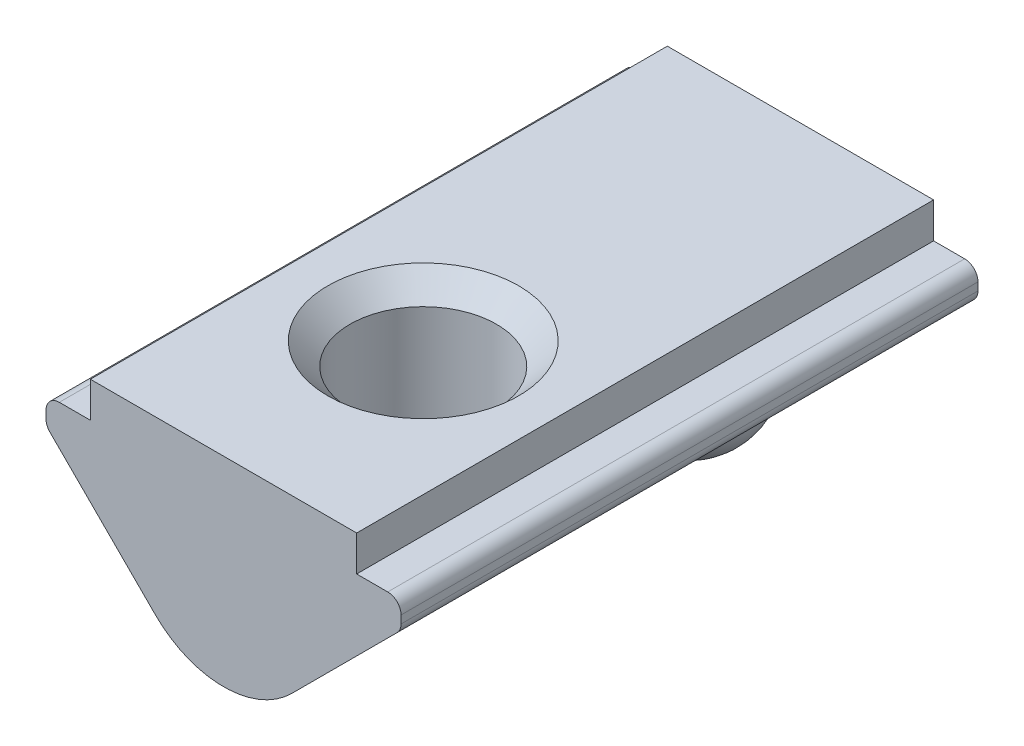
ISO-10303-21;
HEADER;
FILE_DESCRIPTION(('STEP AP214'),'2;1');
FILE_NAME('part.step','',(''),(''),'','','');
FILE_SCHEMA(('AUTOMOTIVE_DESIGN { 1 0 10303 214 1 1 1 1 }'));
ENDSEC;
DATA;
#1=APPLICATION_CONTEXT('core data for automotive mechanical design processes');
#2=APPLICATION_PROTOCOL_DEFINITION('international standard','automotive_design',2000,#1);
#3=PRODUCT_CONTEXT('',#1,'mechanical');
#4=PRODUCT('Part','Part','',(#3));
#5=PRODUCT_RELATED_PRODUCT_CATEGORY('part','',(#4));
#6=PRODUCT_DEFINITION_FORMATION('','',#4);
#7=PRODUCT_DEFINITION_CONTEXT('part definition',#1,'design');
#8=PRODUCT_DEFINITION('design','',#6,#7);
#9=PRODUCT_DEFINITION_SHAPE('','',#8);
#10=(LENGTH_UNIT() NAMED_UNIT(*) SI_UNIT(.MILLI.,.METRE.));
#11=(NAMED_UNIT(*) PLANE_ANGLE_UNIT() SI_UNIT($,.RADIAN.));
#12=(NAMED_UNIT(*) SI_UNIT($,.STERADIAN.) SOLID_ANGLE_UNIT());
#13=UNCERTAINTY_MEASURE_WITH_UNIT(LENGTH_MEASURE(1.E-05),#10,'distance_accuracy_value','');
#14=(GEOMETRIC_REPRESENTATION_CONTEXT(3) GLOBAL_UNCERTAINTY_ASSIGNED_CONTEXT((#13)) GLOBAL_UNIT_ASSIGNED_CONTEXT((#10,
#11,#12)) REPRESENTATION_CONTEXT('',''));
#15=CARTESIAN_POINT('',(0.,0.,0.));
#16=DIRECTION('',(0.,0.,1.));
#17=DIRECTION('',(1.,0.,0.));
#18=AXIS2_PLACEMENT_3D('',#15,#16,#17);
#19=CARTESIAN_POINT('',(0.,-2.3272077938642,6.5));
#20=DIRECTION('',(0.,0.,-1.));
#21=DIRECTION('',(-1.,0.,0.));
#22=AXIS2_PLACEMENT_3D('',#19,#20,#21);
#23=CYLINDRICAL_SURFACE('',#22,2.1727922061358);
#24=CARTESIAN_POINT('',(0.,-4.5,-2.8819660112501));
#25=CARTESIAN_POINT('',(0.0842303309173296,-4.49999855111517,-2.88196633157336));
#26=CARTESIAN_POINT('',(0.16847119543235,-4.49507118850862,-2.88710048706043));
#27=CARTESIAN_POINT('',(0.334563064093868,-4.47571560869941,-2.90768842694785));
#28=CARTESIAN_POINT('',(0.416414003630831,-4.4612871348904,-2.9231424900688));
#29=CARTESIAN_POINT('',(0.575407421912194,-4.42401419278143,-2.96452960837165));
#30=CARTESIAN_POINT('',(0.652550469946638,-4.40117074440119,-2.99046139365961));
#31=CARTESIAN_POINT('',(0.800002481194144,-4.34887590636583,-3.05315759958394));
#32=CARTESIAN_POINT('',(0.870305106224547,-4.31941847035847,-3.0899319419261));
#33=CARTESIAN_POINT('',(1.00116691911539,-4.25694776026208,-3.17436574832074));
#34=CARTESIAN_POINT('',(1.06181492041801,-4.22397220182363,-3.22191489589671));
#35=CARTESIAN_POINT('',(1.17182208721126,-4.15803908903499,-3.32863324249409));
#36=CARTESIAN_POINT('',(1.22121213180819,-4.12508173895149,-3.3877698084312));
#37=CARTESIAN_POINT('',(1.29003653326974,-4.07589491550365,-3.49318898289668));
#38=CARTESIAN_POINT('',(1.31374927827934,-4.05803780858356,-3.53593371820567));
#39=CARTESIAN_POINT('',(1.35494043677892,-4.0259840392101,-3.62562018448564));
#40=CARTESIAN_POINT('',(1.37242493804386,-4.01178380614159,-3.67255776072359));
#41=CARTESIAN_POINT('',(1.40045312716439,-3.98856233894596,-3.77025727943218));
#42=CARTESIAN_POINT('',(1.41092788072989,-3.97959264969888,-3.82105188720173));
#43=CARTESIAN_POINT('',(1.42394755705963,-3.96839017175623,-3.9243703584753));
#44=CARTESIAN_POINT('',(1.42650051336135,-3.96615055812741,-3.97689241548578));
#45=CARTESIAN_POINT('',(1.42372574834378,-3.96855713450931,-4.0739698188989));
#46=CARTESIAN_POINT('',(1.41947697116526,-3.97226077313887,-4.11858620613709));
#47=CARTESIAN_POINT('',(1.40528823238396,-3.98439729940903,-4.20623201513968));
#48=CARTESIAN_POINT('',(1.39534706719625,-3.99283118719448,-4.24926109923983));
#49=CARTESIAN_POINT('',(1.37018056785478,-4.01359286620544,-4.33294811804719));
#50=CARTESIAN_POINT('',(1.35493115899743,-4.02593837466991,-4.37359424675713));
#51=CARTESIAN_POINT('',(1.3197164608509,-4.05343910991889,-4.45175680581398));
#52=CARTESIAN_POINT('',(1.29974826616946,-4.0685960664918,-4.48927128864845));
#53=CARTESIAN_POINT('',(1.24459149962959,-4.10868998559647,-4.57882667993944));
#54=CARTESIAN_POINT('',(1.20678188896966,-4.13473099777314,-4.62876623852903));
#55=CARTESIAN_POINT('',(1.12328417546792,-4.18777619812761,-4.72096221660325));
#56=CARTESIAN_POINT('',(1.0775825044373,-4.21478198047074,-4.76320514251109));
#57=CARTESIAN_POINT('',(0.978753321303708,-4.26789532034229,-4.84089967514649));
#58=CARTESIAN_POINT('',(0.925509924549038,-4.29397891100982,-4.87621959826439));
#59=CARTESIAN_POINT('',(0.813471166476377,-4.34290433495116,-4.93942299137123));
#60=CARTESIAN_POINT('',(0.754677240720898,-4.36574700263737,-4.96730837709757));
#61=CARTESIAN_POINT('',(0.621943788707839,-4.41045739012713,-5.02019168950936));
#62=CARTESIAN_POINT('',(0.547158068491612,-4.43144882560476,-5.0438217054878));
#63=CARTESIAN_POINT('',(0.393446841529932,-4.46553276604001,-5.0814366908944));
#64=CARTESIAN_POINT('',(0.314519071093556,-4.47862090182166,-5.09541632591912));
#65=CARTESIAN_POINT('',(0.151400289992606,-4.49633087176125,-5.11422047718119));
#66=CARTESIAN_POINT('',(0.0671249533959798,-4.50059384801617,-5.11865721517349));
#67=CARTESIAN_POINT('',(-0.101254328687025,-4.4992721271511,-5.11727016892315));
#68=CARTESIAN_POINT('',(-0.185358284529483,-4.49368804386192,-5.11144702424526));
#69=CARTESIAN_POINT('',(-0.35113174844667,-4.4730682467818,-5.08947281741961));
#70=CARTESIAN_POINT('',(-0.432797988744982,-4.45802039460013,-5.07330849103682));
#71=CARTESIAN_POINT('',(-0.59130689253848,-4.41958274227056,-5.03045377036557));
#72=CARTESIAN_POINT('',(-0.668147475527518,-4.39618937272923,-5.00375887161402));
#73=CARTESIAN_POINT('',(-0.814718890163093,-4.34297972355502,-4.93953683249765));
#74=CARTESIAN_POINT('',(-0.884452670817997,-4.31316612415247,-4.90201421012796));
#75=CARTESIAN_POINT('',(-1.01464568029042,-4.24989748771758,-4.81561719161915));
#76=CARTESIAN_POINT('',(-1.07511394519103,-4.21644605359357,-4.76675397375317));
#77=CARTESIAN_POINT('',(-1.16928055316175,-4.15913814452597,-4.67234133882737));
#78=CARTESIAN_POINT('',(-1.20575807813653,-4.13518578907621,-4.6296105287969));
#79=CARTESIAN_POINT('',(-1.27154321895058,-4.08953541447432,-4.53788092869314));
#80=CARTESIAN_POINT('',(-1.30086271786266,-4.06783369397031,-4.48889273537551));
#81=CARTESIAN_POINT('',(-1.34593786475505,-4.03311484221702,-4.39570462054));
#82=CARTESIAN_POINT('',(-1.36324195092989,-4.01922938507074,-4.35258183902105));
#83=CARTESIAN_POINT('',(-1.39184227970683,-3.9957835846973,-4.26325869347268));
#84=CARTESIAN_POINT('',(-1.40314330241723,-3.98621980112478,-4.21706081116725));
#85=CARTESIAN_POINT('',(-1.4191946126179,-3.97251305993219,-4.12240949520959));
#86=CARTESIAN_POINT('',(-1.42390185058917,-3.96840573535232,-4.0739433542438));
#87=CARTESIAN_POINT('',(-1.42631627340881,-3.96630869989105,-3.97670811204484));
#88=CARTESIAN_POINT('',(-1.42402551773873,-3.96831718914949,-3.92793910415993));
#89=CARTESIAN_POINT('',(-1.41319292873848,-3.97764775845865,-3.83676111482451));
#90=CARTESIAN_POINT('',(-1.40531306689323,-3.98440650566728,-3.79421108606796));
#91=CARTESIAN_POINT('',(-1.38442633240564,-4.00189412926015,-3.71125363318761));
#92=CARTESIAN_POINT('',(-1.37141722395496,-4.01262473682984,-3.67084715214947));
#93=CARTESIAN_POINT('',(-1.33567747186543,-4.04117041666565,-3.57991300821325));
#94=CARTESIAN_POINT('',(-1.31115458891478,-4.06015479502001,-3.53045776082309));
#95=CARTESIAN_POINT('',(-1.25504465797441,-4.10121464460792,-3.4371457552608));
#96=CARTESIAN_POINT('',(-1.22344388269068,-4.12329609094912,-3.39330013994697));
#97=CARTESIAN_POINT('',(-1.14450321349988,-4.17488927914732,-3.29987057606816));
#98=CARTESIAN_POINT('',(-1.09523337930063,-4.20475155208763,-3.25211268447254));
#99=CARTESIAN_POINT('',(-0.988587325079709,-4.26303461411386,-3.16570684057961));
#100=CARTESIAN_POINT('',(-0.931206372423186,-4.29145454838024,-3.12706424220901));
#101=CARTESIAN_POINT('',(-0.8090743005586,-4.34486106466388,-3.05802658700122));
#102=CARTESIAN_POINT('',(-0.744235105523627,-4.36979681047844,-3.02774837988607));
#103=CARTESIAN_POINT('',(-0.609408359556503,-4.41399563728596,-2.9758213360058));
#104=CARTESIAN_POINT('',(-0.539421907015559,-4.4332599241669,-2.95417066447338));
#105=CARTESIAN_POINT('',(-0.392349601983774,-4.46567193528795,-2.91841938093128));
#106=CARTESIAN_POINT('',(-0.315083894665737,-4.47847295264263,-2.90474160136218));
#107=CARTESIAN_POINT('',(-0.158548954341807,-4.49563889887239,-2.88651343280822));
#108=CARTESIAN_POINT('',(-0.0792791429869385,-4.50000136371716,-2.88196570975594));
#109=CARTESIAN_POINT('',(0.,-4.5,-2.8819660112501));
#110=B_SPLINE_CURVE_WITH_KNOTS('',3,(#24,#25,#26,#27,#28,#29,#30,#31,#32,#33,#34,#35,#36,#37,
#38,#39,#40,#41,#42,#43,#44,#45,#46,#47,#48,#49,#50,#51,#52,#53,#54,#55,#56,#57,#58,#59,#60,#61,
#62,#63,#64,#65,#66,#67,#68,#69,#70,#71,#72,#73,#74,#75,#76,#77,#78,#79,#80,#81,#82,#83,#84,#85,
#86,#87,#88,#89,#90,#91,#92,#93,#94,#95,#96,#97,#98,#99,#100,#101,#102,#103,#104,#105,#106,#107,
#108,#109),.UNSPECIFIED.,.T.,.F.,(4,2,2,2,2,2,2,2,2,2,2,2,2,2,2,2,2,2,2,2,2,2,2,2,2,2,2,2,2,2,2,
2,2,2,2,2,2,2,2,2,2,2,4),(0.,0.252411735178092,0.504830287780983,0.757218256572261,
1.0098378987951,1.25997946392424,1.50942643822576,1.66499879554141,1.8204186692244,
1.97734533181334,2.1341128021284,2.26837014720749,2.40265588982667,2.53755877486978,
2.67254493805455,2.87494155135125,3.07768965770269,3.2839833704589,3.49022387379938,
3.73269674695461,3.97530354380059,4.22759586219719,4.4798724541404,4.7324732820823,
4.98518227765419,5.23778597952022,5.49014174289248,5.67272997324359,5.85501299481085,
5.99992791480923,6.14472726858611,6.29046765108396,6.43616514690186,6.56699003630751,
6.69787201466712,6.87204089572346,7.04655054134616,7.26987921484621,7.49333873707935,
7.71977802563765,7.9461691329506,8.18367437921688,8.42124896579195),.UNSPECIFIED.);
#111=CARTESIAN_POINT('',(0.,-4.5,-2.8819660112501));
#112=VERTEX_POINT('',#111);
#113=EDGE_CURVE('E247',#112,#112,#110,.T.);
#114=ORIENTED_EDGE('',*,*,#113,.T.);
#115=EDGE_LOOP('',(#114));
#116=FACE_BOUND('',#115,.T.);
#117=DIRECTION('',(0.,0.,-1.));
#118=VECTOR('',#117,1.);
#119=CARTESIAN_POINT('',(1.53639610306791,-3.8636038969321,6.5));
#120=LINE('',#119,#118);
#121=CARTESIAN_POINT('',(1.53639610306791,-3.8636038969321,1.39834643317126));
#122=VERTEX_POINT('',#121);
#123=CARTESIAN_POINT('',(1.53639610306791,-3.8636038969321,-6.5));
#124=VERTEX_POINT('',#123);
#125=EDGE_CURVE('E250',#122,#124,#120,.T.);
#126=ORIENTED_EDGE('',*,*,#125,.F.);
#127=CARTESIAN_POINT('',(1.53639610306791,-3.8636038969321,1.39834643317126));
#128=CARTESIAN_POINT('',(1.51798672350017,-3.88202536632882,1.35137388321363));
#129=CARTESIAN_POINT('',(1.49763459849312,-3.90170516795988,1.30571016320795));
#130=CARTESIAN_POINT('',(1.45325673263723,-3.94274870414904,1.21704905301451));
#131=CARTESIAN_POINT('',(1.42923416087841,-3.96411097841157,1.17404940723481));
#132=CARTESIAN_POINT('',(1.37756094867566,-4.00783458824742,1.09046759226623));
#133=CARTESIAN_POINT('',(1.3498920853186,-4.03020054280447,1.04989916220046));
#134=CARTESIAN_POINT('',(1.29113096485775,-4.07517159926019,0.971465638851749));
#135=CARTESIAN_POINT('',(1.26003783762209,-4.09777676061799,0.933601236731193));
#136=CARTESIAN_POINT('',(1.16187542301055,-4.16496101035647,0.824363438386426));
#137=CARTESIAN_POINT('',(1.08976581174793,-4.20904849096976,0.757091635812529));
#138=CARTESIAN_POINT('',(0.932832801163741,-4.2915598680529,0.635400922769662));
#139=CARTESIAN_POINT('',(0.848044112863698,-4.3299986760444,0.580947935160935));
#140=CARTESIAN_POINT('',(0.688960707900832,-4.38917608596503,0.498738775498754));
#141=CARTESIAN_POINT('',(0.617117576456379,-4.41194622567026,0.467710711615212));
#142=CARTESIAN_POINT('',(0.468037849043666,-4.45038352604182,0.415810871902004));
#143=CARTESIAN_POINT('',(0.390805025328544,-4.46605559823979,0.394932072519303));
#144=CARTESIAN_POINT('',(0.232452735708539,-4.4890173538444,0.364458433567399));
#145=CARTESIAN_POINT('',(0.151314601288778,-4.49626150362479,0.354924882817784));
#146=CARTESIAN_POINT('',(-0.0117772759221922,-4.50149763742523,0.348026537385566));
#147=CARTESIAN_POINT('',(-0.0937308396031501,-4.49949161036784,0.350659126806136));
#148=CARTESIAN_POINT('',(-0.248521433404486,-4.4870152533569,0.367129476607792));
#149=CARTESIAN_POINT('',(-0.321530483860951,-4.47729788857845,0.379970625275085));
#150=CARTESIAN_POINT('',(-0.464012718811886,-4.45111182194872,0.41488945928228));
#151=CARTESIAN_POINT('',(-0.533485552421487,-4.4346424515849,0.436968059221859));
#152=CARTESIAN_POINT('',(-0.671024939045593,-4.39509010197614,0.490708915701304));
#153=CARTESIAN_POINT('',(-0.738832961173949,-4.37170914398218,0.522807746586645));
#154=CARTESIAN_POINT('',(-0.86816583324533,-4.32023771589067,0.59490932356849));
#155=CARTESIAN_POINT('',(-0.929685835555192,-4.292143655731,0.634918099002752));
#156=CARTESIAN_POINT('',(-1.05630262191101,-4.22751290829321,0.729551998587101));
#157=CARTESIAN_POINT('',(-1.12008658822667,-4.19036358985143,0.785511200565121));
#158=CARTESIAN_POINT('',(-1.23787547509536,-4.11427374349094,0.905806294697627));
#159=CARTESIAN_POINT('',(-1.29188052897266,-4.07533324000206,0.970142072626538));
#160=CARTESIAN_POINT('',(-1.38024712140402,-4.00603220275669,1.09336514648042));
#161=CARTESIAN_POINT('',(-1.41638570348486,-3.97547881971518,1.15086991959079));
#162=CARTESIAN_POINT('',(-1.46539056997517,-3.93161990087417,1.24085894904059));
#163=CARTESIAN_POINT('',(-1.48085411857191,-3.91733317032605,1.27146657136991));
#164=CARTESIAN_POINT('',(-1.50999014992833,-3.88969315325436,1.33395443838348));
#165=CARTESIAN_POINT('',(-1.52366153992781,-3.87634043853519,1.36583544419415));
#166=CARTESIAN_POINT('',(-1.53639610306791,-3.8636038969321,1.39834643317126));
#167=B_SPLINE_CURVE_WITH_KNOTS('',3,(#127,#128,#129,#130,#131,#132,#133,#134,#135,#136,#137,
#138,#139,#140,#141,#142,#143,#144,#145,#146,#147,#148,#149,#150,#151,#152,#153,#154,#155,#156,
#157,#158,#159,#160,#161,#162,#163,#164,#165,#166),.UNSPECIFIED.,.F.,.F.,(4,2,2,2,2,2,2,2,2,2,2,
2,2,2,2,2,2,2,2,4),(0.,0.16099359810598,0.321848970581566,0.483541101749552,0.645274415353859,
0.967763445016806,1.28938524651928,1.53290603397404,1.77625805799284,2.02091882515,
2.26552698913684,2.48881574338847,2.71212661068431,2.94698610539392,3.1820253162842,
3.4589051637246,3.73578123594129,3.9586860879847,4.07006514011108,4.18151179228853),.UNSPECIFIED.);
#168=CARTESIAN_POINT('',(-1.53639610306791,-3.8636038969321,1.39834643317126));
#169=VERTEX_POINT('',#168);
#170=EDGE_CURVE('E161',#122,#169,#167,.T.);
#171=ORIENTED_EDGE('',*,*,#170,.T.);
#172=DIRECTION('',(0.,0.,-1.));
#173=VECTOR('',#172,1.);
#174=CARTESIAN_POINT('',(-1.53639610306791,-3.8636038969321,6.5));
#175=LINE('',#174,#173);
#176=CARTESIAN_POINT('',(-1.53639610306791,-3.8636038969321,-6.5));
#177=VERTEX_POINT('',#176);
#178=EDGE_CURVE('E171',#169,#177,#175,.T.);
#179=ORIENTED_EDGE('',*,*,#178,.T.);
#180=CARTESIAN_POINT('',(0.,-2.3272077938642,-6.5));
#181=DIRECTION('',(0.,0.,1.));
#182=DIRECTION('',(-1.,0.,0.));
#183=AXIS2_PLACEMENT_3D('',#180,#181,#182);
#184=CIRCLE('',#183,2.1727922061358);
#185=EDGE_CURVE('E252',#177,#124,#184,.T.);
#186=ORIENTED_EDGE('',*,*,#185,.T.);
#187=EDGE_LOOP('',(#126,#171,#179,#186));
#188=FACE_BOUND('',#187,.T.);
#189=ADVANCED_FACE('F37',(#116,#188),#23,.T.);
#190=CARTESIAN_POINT('',(3.,0.,6.5));
#191=DIRECTION('',(-1.,0.,0.));
#192=DIRECTION('',(0.,0.,1.));
#193=AXIS2_PLACEMENT_3D('',#190,#191,#192);
#194=PLANE('',#193);
#195=DIRECTION('',(0.,1.,0.));
#196=VECTOR('',#195,1.);
#197=CARTESIAN_POINT('',(3.,0.,-6.5));
#198=LINE('',#197,#196);
#199=CARTESIAN_POINT('',(3.,-0.8,-6.5));
#200=VERTEX_POINT('',#199);
#201=CARTESIAN_POINT('',(3.,0.,-6.5));
#202=VERTEX_POINT('',#201);
#203=EDGE_CURVE('E285',#200,#202,#198,.T.);
#204=ORIENTED_EDGE('',*,*,#203,.T.);
#205=DIRECTION('',(0.,0.,-1.));
#206=VECTOR('',#205,1.);
#207=CARTESIAN_POINT('',(3.,0.,6.5));
#208=LINE('',#207,#206);
#209=CARTESIAN_POINT('',(3.,0.,6.5));
#210=VERTEX_POINT('',#209);
#211=EDGE_CURVE('E162',#210,#202,#208,.T.);
#212=ORIENTED_EDGE('',*,*,#211,.F.);
#213=DIRECTION('',(0.,1.,0.));
#214=VECTOR('',#213,1.);
#215=CARTESIAN_POINT('',(3.,0.,6.5));
#216=LINE('',#215,#214);
#217=CARTESIAN_POINT('',(3.,-0.8,6.5));
#218=VERTEX_POINT('',#217);
#219=EDGE_CURVE('E266',#218,#210,#216,.T.);
#220=ORIENTED_EDGE('',*,*,#219,.F.);
#221=DIRECTION('',(0.,0.,-1.));
#222=VECTOR('',#221,1.);
#223=CARTESIAN_POINT('',(3.,-0.8,6.5));
#224=LINE('',#223,#222);
#225=EDGE_CURVE('E254',#218,#200,#224,.T.);
#226=ORIENTED_EDGE('',*,*,#225,.T.);
#227=EDGE_LOOP('',(#204,#212,#220,#226));
#228=FACE_BOUND('',#227,.T.);
#229=ADVANCED_FACE('F234',(#228),#194,.F.);
#230=CARTESIAN_POINT('',(-3.,0.,6.5));
#231=DIRECTION('',(0.,-1.,0.));
#232=DIRECTION('',(0.,0.,-1.));
#233=AXIS2_PLACEMENT_3D('',#230,#231,#232);
#234=PLANE('',#233);
#235=CARTESIAN_POINT('',(0.,0.,2.));
#236=DIRECTION('',(0.,1.,0.));
#237=DIRECTION('',(0.,0.,1.));
#238=AXIS2_PLACEMENT_3D('',#235,#236,#237);
#239=CIRCLE('',#238,2.15);
#240=CARTESIAN_POINT('',(0.,0.,4.15));
#241=VERTEX_POINT('',#240);
#242=EDGE_CURVE('E308',#241,#241,#239,.T.);
#243=ORIENTED_EDGE('',*,*,#242,.F.);
#244=EDGE_LOOP('',(#243));
#245=FACE_BOUND('',#244,.T.);
#246=DIRECTION('',(-1.,0.,0.));
#247=VECTOR('',#246,1.);
#248=CARTESIAN_POINT('',(-3.,0.,-6.5));
#249=LINE('',#248,#247);
#250=CARTESIAN_POINT('',(-3.,0.,-6.5));
#251=VERTEX_POINT('',#250);
#252=EDGE_CURVE('E283',#202,#251,#249,.T.);
#253=ORIENTED_EDGE('',*,*,#252,.T.);
#254=DIRECTION('',(0.,0.,-1.));
#255=VECTOR('',#254,1.);
#256=CARTESIAN_POINT('',(-3.,0.,6.5));
#257=LINE('',#256,#255);
#258=CARTESIAN_POINT('',(-3.,0.,6.5));
#259=VERTEX_POINT('',#258);
#260=EDGE_CURVE('E179',#259,#251,#257,.T.);
#261=ORIENTED_EDGE('',*,*,#260,.F.);
#262=DIRECTION('',(-1.,0.,0.));
#263=VECTOR('',#262,1.);
#264=CARTESIAN_POINT('',(-3.,0.,6.5));
#265=LINE('',#264,#263);
#266=EDGE_CURVE('E301',#210,#259,#265,.T.);
#267=ORIENTED_EDGE('',*,*,#266,.F.);
#268=ORIENTED_EDGE('',*,*,#211,.T.);
#269=EDGE_LOOP('',(#253,#261,#267,#268));
#270=FACE_BOUND('',#269,.T.);
#271=ADVANCED_FACE('F241',(#245,#270),#234,.F.);
#272=CARTESIAN_POINT('',(-3.,0.,6.5));
#273=DIRECTION('',(1.,0.,0.));
#274=DIRECTION('',(0.,0.,-1.));
#275=AXIS2_PLACEMENT_3D('',#272,#273,#274);
#276=PLANE('',#275);
#277=DIRECTION('',(0.,-1.,0.));
#278=VECTOR('',#277,1.);
#279=CARTESIAN_POINT('',(-3.,0.,-6.5));
#280=LINE('',#279,#278);
#281=CARTESIAN_POINT('',(-3.,-0.8,-6.5));
#282=VERTEX_POINT('',#281);
#283=EDGE_CURVE('E281',#251,#282,#280,.T.);
#284=ORIENTED_EDGE('',*,*,#283,.T.);
#285=DIRECTION('',(0.,0.,-1.));
#286=VECTOR('',#285,1.);
#287=CARTESIAN_POINT('',(-3.,-0.8,6.5));
#288=LINE('',#287,#286);
#289=CARTESIAN_POINT('',(-3.,-0.8,6.5));
#290=VERTEX_POINT('',#289);
#291=EDGE_CURVE('E176',#290,#282,#288,.T.);
#292=ORIENTED_EDGE('',*,*,#291,.F.);
#293=DIRECTION('',(0.,-1.,0.));
#294=VECTOR('',#293,1.);
#295=CARTESIAN_POINT('',(-3.,0.,6.5));
#296=LINE('',#295,#294);
#297=EDGE_CURVE('E299',#259,#290,#296,.T.);
#298=ORIENTED_EDGE('',*,*,#297,.F.);
#299=ORIENTED_EDGE('',*,*,#260,.T.);
#300=EDGE_LOOP('',(#284,#292,#298,#299));
#301=FACE_BOUND('',#300,.T.);
#302=ADVANCED_FACE('F395',(#301),#276,.F.);
#303=CARTESIAN_POINT('',(-3.,-0.8,6.5));
#304=DIRECTION('',(0.,-1.,0.));
#305=DIRECTION('',(1.,0.,0.));
#306=AXIS2_PLACEMENT_3D('',#303,#304,#305);
#307=PLANE('',#306);
#308=DIRECTION('',(-1.,0.,0.));
#309=VECTOR('',#308,1.);
#310=CARTESIAN_POINT('',(-3.,-0.8,-6.5));
#311=LINE('',#310,#309);
#312=CARTESIAN_POINT('',(-3.7,-0.8,-6.5));
#313=VERTEX_POINT('',#312);
#314=EDGE_CURVE('E278',#282,#313,#311,.T.);
#315=ORIENTED_EDGE('',*,*,#314,.T.);
#316=DIRECTION('',(0.,0.,-1.));
#317=VECTOR('',#316,1.);
#318=CARTESIAN_POINT('',(-3.7,-0.8,6.5));
#319=LINE('',#318,#317);
#320=CARTESIAN_POINT('',(-3.7,-0.8,6.5));
#321=VERTEX_POINT('',#320);
#322=EDGE_CURVE('E45',#313,#321,#319,.F.);
#323=ORIENTED_EDGE('',*,*,#322,.T.);
#324=DIRECTION('',(-1.,0.,0.));
#325=VECTOR('',#324,1.);
#326=CARTESIAN_POINT('',(-3.,-0.8,6.5));
#327=LINE('',#326,#325);
#328=EDGE_CURVE('E296',#290,#321,#327,.T.);
#329=ORIENTED_EDGE('',*,*,#328,.F.);
#330=ORIENTED_EDGE('',*,*,#291,.T.);
#331=EDGE_LOOP('',(#315,#323,#329,#330));
#332=FACE_BOUND('',#331,.T.);
#333=ADVANCED_FACE('F385',(#332),#307,.F.);
#334=CARTESIAN_POINT('',(-4.,-0.8,6.5));
#335=DIRECTION('',(1.,0.,0.));
#336=DIRECTION('',(0.,0.,-1.));
#337=AXIS2_PLACEMENT_3D('',#334,#335,#336);
#338=PLANE('',#337);
#339=DIRECTION('',(0.,-1.,0.));
#340=VECTOR('',#339,1.);
#341=CARTESIAN_POINT('',(-4.,-0.8,6.5));
#342=LINE('',#341,#340);
#343=CARTESIAN_POINT('',(-4.,-1.1,6.5));
#344=VERTEX_POINT('',#343);
#345=CARTESIAN_POINT('',(-4.,-1.27573593128807,6.5));
#346=VERTEX_POINT('',#345);
#347=EDGE_CURVE('E294',#344,#346,#342,.T.);
#348=ORIENTED_EDGE('',*,*,#347,.F.);
#349=DIRECTION('',(0.,0.,-1.));
#350=VECTOR('',#349,1.);
#351=CARTESIAN_POINT('',(-4.,-1.1,6.5));
#352=LINE('',#351,#350);
#353=CARTESIAN_POINT('',(-4.,-1.1,-6.5));
#354=VERTEX_POINT('',#353);
#355=EDGE_CURVE('E479',#344,#354,#352,.T.);
#356=ORIENTED_EDGE('',*,*,#355,.T.);
#357=DIRECTION('',(0.,-1.,0.));
#358=VECTOR('',#357,1.);
#359=CARTESIAN_POINT('',(-4.,-0.8,-6.5));
#360=LINE('',#359,#358);
#361=CARTESIAN_POINT('',(-4.,-1.27573593128807,-6.5));
#362=VERTEX_POINT('',#361);
#363=EDGE_CURVE('E275',#354,#362,#360,.T.);
#364=ORIENTED_EDGE('',*,*,#363,.T.);
#365=DIRECTION('',(0.,0.,-1.));
#366=VECTOR('',#365,1.);
#367=CARTESIAN_POINT('',(-4.,-1.27573593128807,6.5));
#368=LINE('',#367,#366);
#369=EDGE_CURVE('E463',#362,#346,#368,.F.);
#370=ORIENTED_EDGE('',*,*,#369,.T.);
#371=EDGE_LOOP('',(#348,#356,#364,#370));
#372=FACE_BOUND('',#371,.T.);
#373=ADVANCED_FACE('F377',(#372),#338,.F.);
#374=CARTESIAN_POINT('',(-1.53639610306791,-3.8636038969321,6.5));
#375=DIRECTION('',(0.707106781186548,0.707106781186547,0.));
#376=DIRECTION('',(-0.707106781186547,0.707106781186548,0.));
#377=AXIS2_PLACEMENT_3D('',#374,#375,#376);
#378=PLANE('',#377);
#379=DIRECTION('',(0.707106781186547,-0.707106781186548,0.));
#380=VECTOR('',#379,1.);
#381=CARTESIAN_POINT('',(-1.53639610306791,-3.8636038969321,6.5));
#382=LINE('',#381,#380);
#383=CARTESIAN_POINT('',(-3.91213203435596,-1.48786796564404,6.5));
#384=VERTEX_POINT('',#383);
#385=CARTESIAN_POINT('',(-1.53639610306791,-3.8636038969321,6.5));
#386=VERTEX_POINT('',#385);
#387=EDGE_CURVE('E292',#384,#386,#382,.T.);
#388=ORIENTED_EDGE('',*,*,#387,.F.);
#389=DIRECTION('',(0.,0.,-1.));
#390=VECTOR('',#389,1.);
#391=CARTESIAN_POINT('',(-3.91213203435596,-1.48786796564404,6.5));
#392=LINE('',#391,#390);
#393=CARTESIAN_POINT('',(-3.91213203435596,-1.48786796564404,-6.5));
#394=VERTEX_POINT('',#393);
#395=EDGE_CURVE('E11',#384,#394,#392,.T.);
#396=ORIENTED_EDGE('',*,*,#395,.T.);
#397=DIRECTION('',(0.707106781186547,-0.707106781186548,0.));
#398=VECTOR('',#397,1.);
#399=CARTESIAN_POINT('',(-1.53639610306791,-3.8636038969321,-6.5));
#400=LINE('',#399,#398);
#401=EDGE_CURVE('E273',#394,#177,#400,.T.);
#402=ORIENTED_EDGE('',*,*,#401,.T.);
#403=ORIENTED_EDGE('',*,*,#178,.F.);
#404=CARTESIAN_POINT('',(0.,-5.40000000000001,2.));
#405=DIRECTION('',(0.707106781186548,0.707106781186547,0.));
#406=DIRECTION('',(-0.707106781186547,0.707106781186548,0.));
#407=AXIS2_PLACEMENT_3D('',#404,#405,#406);
#408=ELLIPSE('',#407,2.33345237791561,1.65);
#409=CARTESIAN_POINT('',(-1.53639610306791,-3.8636038969321,2.60165356682874));
#410=VERTEX_POINT('',#409);
#411=EDGE_CURVE('E153',#169,#410,#408,.T.);
#412=ORIENTED_EDGE('',*,*,#411,.T.);
#413=EDGE_CURVE('E168',#386,#410,#175,.T.);
#414=ORIENTED_EDGE('',*,*,#413,.F.);
#415=EDGE_LOOP('',(#388,#396,#402,#403,#412,#414));
#416=FACE_BOUND('',#415,.T.);
#417=ADVANCED_FACE('F167',(#416),#378,.F.);
#418=ORIENTED_EDGE('',*,*,#413,.T.);
#419=CARTESIAN_POINT('',(-1.53639610306791,-3.8636038969321,2.60165356682874));
#420=CARTESIAN_POINT('',(-1.51798614157982,-3.88202595793081,2.64862761827657));
#421=CARTESIAN_POINT('',(-1.49763329934354,-3.90170642893969,2.69429275826127));
#422=CARTESIAN_POINT('',(-1.45325374654565,-3.94275140715388,2.78295658556574));
#423=CARTESIAN_POINT('',(-1.42923020134741,-3.96411445580117,2.82595752582969));
#424=CARTESIAN_POINT('',(-1.3775565150747,-4.00783821170445,2.90953904851799));
#425=CARTESIAN_POINT('',(-1.34988837820152,-4.03020348017148,2.95010606288365));
#426=CARTESIAN_POINT('',(-1.2911288753798,-4.07517309801989,3.02853687315315));
#427=CARTESIAN_POINT('',(-1.26003664455493,-4.09777750649528,3.06639998209035));
#428=CARTESIAN_POINT('',(-1.1618841568424,-4.16495517367433,3.17562705940136));
#429=CARTESIAN_POINT('',(-1.08978576781515,-4.20903697314116,3.24289072070184));
#430=CARTESIAN_POINT('',(-0.932853927994602,-4.29154978084306,3.36458484983015));
#431=CARTESIAN_POINT('',(-0.848051835019362,-4.32999425433751,3.41904609164172));
#432=CARTESIAN_POINT('',(-0.688921047100978,-4.38919201291534,3.50128322184404));
#433=CARTESIAN_POINT('',(-0.617038265757407,-4.41197467256628,3.53232763649568));
#434=CARTESIAN_POINT('',(-0.467930482796325,-4.45040322666909,3.58421578828395));
#435=CARTESIAN_POINT('',(-0.390716112020311,-4.46606287618167,3.60507919143342));
#436=CARTESIAN_POINT('',(-0.26082864883297,-4.48490635716454,3.63008462896534));
#437=CARTESIAN_POINT('',(-0.209121503250654,-4.49054316917197,3.63753002973654));
#438=CARTESIAN_POINT('',(-0.104951812734401,-4.49809228340944,3.64749020651825));
#439=CARTESIAN_POINT('',(-0.0524891119808629,-4.50000380595613,3.65000395035984));
#440=CARTESIAN_POINT('',(0.0803795950621548,-4.49999417172056,3.64999395058684));
#441=CARTESIAN_POINT('',(0.160821125925575,-4.49549679126707,3.64408376783708));
#442=CARTESIAN_POINT('',(0.319101500538573,-4.47792078940812,3.62083190084713));
#443=CARTESIAN_POINT('',(0.396936950093545,-4.4648314021916,3.60347587480237));
#444=CARTESIAN_POINT('',(0.547368943448036,-4.43132797876726,3.55853085132566));
#445=CARTESIAN_POINT('',(0.619992873456849,-4.41095620993278,3.53100087356826));
#446=CARTESIAN_POINT('',(0.759128911240697,-4.36439701279321,3.4670023131725));
#447=CARTESIAN_POINT('',(0.825639574096526,-4.33820821455897,3.43053162475786));
#448=CARTESIAN_POINT('',(0.957698897955418,-4.27901569240305,3.34611268128896));
#449=CARTESIAN_POINT('',(1.02257804918161,-4.24560399317723,3.29741076784767));
#450=CARTESIAN_POINT('',(1.14375233202041,-4.17592143662056,3.19196921326381));
#451=CARTESIAN_POINT('',(1.2000410492434,-4.13964847317086,3.13522362638208));
#452=CARTESIAN_POINT('',(1.28169624430323,-4.08209138921719,3.04012042219438));
#453=CARTESIAN_POINT('',(1.31004985538799,-4.06097726160205,3.00417581965307));
#454=CARTESIAN_POINT('',(1.36375258461395,-4.01906007996014,2.92993392725944));
#455=CARTESIAN_POINT('',(1.38910209242918,-3.99825698589459,2.89163694352435));
#456=CARTESIAN_POINT('',(1.43668199072703,-3.9575292572845,2.8127527750661));
#457=CARTESIAN_POINT('',(1.4589150327959,-3.937603885968,2.77216757896693));
#458=CARTESIAN_POINT('',(1.50013709020164,-3.89928156498489,2.68865770887098));
#459=CARTESIAN_POINT('',(1.51912379503961,-3.88088570865639,2.64573139706798));
#460=CARTESIAN_POINT('',(1.53639610306791,-3.8636038969321,2.60165356682874));
#461=B_SPLINE_CURVE_WITH_KNOTS('',3,(#419,#420,#421,#422,#423,#424,#425,#426,#427,#428,#429,
#430,#431,#432,#433,#434,#435,#436,#437,#438,#439,#440,#441,#442,#443,#444,#445,#446,#447,#448,
#449,#450,#451,#452,#453,#454,#455,#456,#457,#458,#459,#460),.UNSPECIFIED.,.F.,.F.,(4,2,2,2,2,2,
2,2,2,2,2,2,2,2,2,2,2,2,2,2,4),(0.,0.160998745224586,0.321859431606413,0.483546455882487,
0.6452744140272,0.967721417104781,1.28938522180332,1.53305794150942,1.77625809236633,
1.93354848102131,2.0908717861872,2.33179000876418,2.57301068033582,2.81285343773716,
3.052752738881,3.31504875886158,3.5775396843227,3.7286636961128,3.87976808350775,
4.0307431159032,4.18182515769371),.UNSPECIFIED.);
#462=CARTESIAN_POINT('',(1.53639610306791,-3.8636038969321,2.60165356682874));
#463=VERTEX_POINT('',#462);
#464=EDGE_CURVE('E150',#410,#463,#461,.T.);
#465=ORIENTED_EDGE('',*,*,#464,.T.);
#466=CARTESIAN_POINT('',(1.53639610306791,-3.8636038969321,6.5));
#467=VERTEX_POINT('',#466);
#468=EDGE_CURVE('E181',#467,#463,#120,.T.);
#469=ORIENTED_EDGE('',*,*,#468,.F.);
#470=CARTESIAN_POINT('',(0.,-2.3272077938642,6.5));
#471=DIRECTION('',(0.,0.,1.));
#472=DIRECTION('',(-1.,0.,0.));
#473=AXIS2_PLACEMENT_3D('',#470,#471,#472);
#474=CIRCLE('',#473,2.1727922061358);
#475=EDGE_CURVE('E175',#386,#467,#474,.T.);
#476=ORIENTED_EDGE('',*,*,#475,.F.);
#477=EDGE_LOOP('',(#418,#465,#469,#476));
#478=FACE_BOUND('',#477,.T.);
#479=ADVANCED_FACE('F174',(#478),#23,.T.);
#480=CARTESIAN_POINT('',(4.,-1.4,6.5));
#481=DIRECTION('',(-0.707106781186548,0.707106781186547,0.));
#482=DIRECTION('',(-0.707106781186547,-0.707106781186548,0.));
#483=AXIS2_PLACEMENT_3D('',#480,#481,#482);
#484=PLANE('',#483);
#485=DIRECTION('',(0.707106781186547,0.707106781186548,0.));
#486=VECTOR('',#485,1.);
#487=CARTESIAN_POINT('',(4.,-1.4,-6.5));
#488=LINE('',#487,#486);
#489=CARTESIAN_POINT('',(3.91213203435596,-1.48786796564404,-6.5));
#490=VERTEX_POINT('',#489);
#491=EDGE_CURVE('E270',#124,#490,#488,.T.);
#492=ORIENTED_EDGE('',*,*,#491,.T.);
#493=DIRECTION('',(0.,0.,-1.));
#494=VECTOR('',#493,1.);
#495=CARTESIAN_POINT('',(3.91213203435596,-1.48786796564404,6.5));
#496=LINE('',#495,#494);
#497=CARTESIAN_POINT('',(3.91213203435596,-1.48786796564404,6.5));
#498=VERTEX_POINT('',#497);
#499=EDGE_CURVE('E465',#490,#498,#496,.F.);
#500=ORIENTED_EDGE('',*,*,#499,.T.);
#501=DIRECTION('',(0.707106781186547,0.707106781186548,0.));
#502=VECTOR('',#501,1.);
#503=CARTESIAN_POINT('',(4.,-1.4,6.5));
#504=LINE('',#503,#502);
#505=EDGE_CURVE('E288',#467,#498,#504,.T.);
#506=ORIENTED_EDGE('',*,*,#505,.F.);
#507=ORIENTED_EDGE('',*,*,#468,.T.);
#508=CARTESIAN_POINT('',(0.,-5.40000000000001,2.));
#509=DIRECTION('',(-0.707106781186548,0.707106781186547,0.));
#510=DIRECTION('',(0.707106781186547,0.707106781186548,0.));
#511=AXIS2_PLACEMENT_3D('',#508,#509,#510);
#512=ELLIPSE('',#511,2.33345237791561,1.65);
#513=EDGE_CURVE('E156',#463,#122,#512,.T.);
#514=ORIENTED_EDGE('',*,*,#513,.T.);
#515=ORIENTED_EDGE('',*,*,#125,.T.);
#516=EDGE_LOOP('',(#492,#500,#506,#507,#514,#515));
#517=FACE_BOUND('',#516,.T.);
#518=ADVANCED_FACE('F224',(#517),#484,.F.);
#519=CARTESIAN_POINT('',(4.,-0.8,6.5));
#520=DIRECTION('',(-1.,0.,0.));
#521=DIRECTION('',(0.,0.,1.));
#522=AXIS2_PLACEMENT_3D('',#519,#520,#521);
#523=PLANE('',#522);
#524=DIRECTION('',(0.,1.,0.));
#525=VECTOR('',#524,1.);
#526=CARTESIAN_POINT('',(4.,-0.8,6.5));
#527=LINE('',#526,#525);
#528=CARTESIAN_POINT('',(4.,-1.27573593128807,6.5));
#529=VERTEX_POINT('',#528);
#530=CARTESIAN_POINT('',(4.,-1.1,6.5));
#531=VERTEX_POINT('',#530);
#532=EDGE_CURVE('E261',#529,#531,#527,.T.);
#533=ORIENTED_EDGE('',*,*,#532,.F.);
#534=DIRECTION('',(0.,0.,-1.));
#535=VECTOR('',#534,1.);
#536=CARTESIAN_POINT('',(4.,-1.27573593128807,6.5));
#537=LINE('',#536,#535);
#538=CARTESIAN_POINT('',(4.,-1.27573593128807,-6.5));
#539=VERTEX_POINT('',#538);
#540=EDGE_CURVE('E494',#529,#539,#537,.T.);
#541=ORIENTED_EDGE('',*,*,#540,.T.);
#542=DIRECTION('',(0.,1.,0.));
#543=VECTOR('',#542,1.);
#544=CARTESIAN_POINT('',(4.,-0.8,-6.5));
#545=LINE('',#544,#543);
#546=CARTESIAN_POINT('',(4.,-1.1,-6.5));
#547=VERTEX_POINT('',#546);
#548=EDGE_CURVE('E267',#539,#547,#545,.T.);
#549=ORIENTED_EDGE('',*,*,#548,.T.);
#550=DIRECTION('',(0.,0.,-1.));
#551=VECTOR('',#550,1.);
#552=CARTESIAN_POINT('',(4.,-1.1,6.5));
#553=LINE('',#552,#551);
#554=EDGE_CURVE('E316',#547,#531,#553,.F.);
#555=ORIENTED_EDGE('',*,*,#554,.T.);
#556=EDGE_LOOP('',(#533,#541,#549,#555));
#557=FACE_BOUND('',#556,.T.);
#558=ADVANCED_FACE('F221',(#557),#523,.F.);
#559=CARTESIAN_POINT('',(3.,-0.8,6.5));
#560=DIRECTION('',(0.,-1.,0.));
#561=DIRECTION('',(1.,0.,0.));
#562=AXIS2_PLACEMENT_3D('',#559,#560,#561);
#563=PLANE('',#562);
#564=DIRECTION('',(-1.,0.,0.));
#565=VECTOR('',#564,1.);
#566=CARTESIAN_POINT('',(3.,-0.8,6.5));
#567=LINE('',#566,#565);
#568=CARTESIAN_POINT('',(3.7,-0.8,6.5));
#569=VERTEX_POINT('',#568);
#570=EDGE_CURVE('E256',#569,#218,#567,.T.);
#571=ORIENTED_EDGE('',*,*,#570,.F.);
#572=DIRECTION('',(0.,0.,-1.));
#573=VECTOR('',#572,1.);
#574=CARTESIAN_POINT('',(3.7,-0.8,6.5));
#575=LINE('',#574,#573);
#576=CARTESIAN_POINT('',(3.7,-0.8,-6.5));
#577=VERTEX_POINT('',#576);
#578=EDGE_CURVE('E475',#569,#577,#575,.T.);
#579=ORIENTED_EDGE('',*,*,#578,.T.);
#580=DIRECTION('',(-1.,0.,0.));
#581=VECTOR('',#580,1.);
#582=CARTESIAN_POINT('',(3.,-0.8,-6.5));
#583=LINE('',#582,#581);
#584=EDGE_CURVE('E264',#577,#200,#583,.T.);
#585=ORIENTED_EDGE('',*,*,#584,.T.);
#586=ORIENTED_EDGE('',*,*,#225,.F.);
#587=EDGE_LOOP('',(#571,#579,#585,#586));
#588=FACE_BOUND('',#587,.T.);
#589=ADVANCED_FACE('F215',(#588),#563,.F.);
#590=CARTESIAN_POINT('',(0.,-2.3272077938642,6.5));
#591=DIRECTION('',(0.,0.,-1.));
#592=DIRECTION('',(-1.,0.,0.));
#593=AXIS2_PLACEMENT_3D('',#590,#591,#592);
#594=PLANE('',#593);
#595=ORIENTED_EDGE('',*,*,#505,.T.);
#596=CARTESIAN_POINT('',(3.7,-1.27573593128807,6.5));
#597=DIRECTION('',(0.,0.,-1.));
#598=DIRECTION('',(-1.,0.,0.));
#599=AXIS2_PLACEMENT_3D('',#596,#597,#598);
#600=CIRCLE('',#599,0.3);
#601=EDGE_CURVE('E473',#498,#529,#600,.F.);
#602=ORIENTED_EDGE('',*,*,#601,.T.);
#603=ORIENTED_EDGE('',*,*,#532,.T.);
#604=CARTESIAN_POINT('',(3.7,-1.1,6.5));
#605=DIRECTION('',(0.,0.,-1.));
#606=DIRECTION('',(-1.,0.,0.));
#607=AXIS2_PLACEMENT_3D('',#604,#605,#606);
#608=CIRCLE('',#607,0.3);
#609=EDGE_CURVE('E52',#531,#569,#608,.F.);
#610=ORIENTED_EDGE('',*,*,#609,.T.);
#611=ORIENTED_EDGE('',*,*,#570,.T.);
#612=ORIENTED_EDGE('',*,*,#219,.T.);
#613=ORIENTED_EDGE('',*,*,#266,.T.);
#614=ORIENTED_EDGE('',*,*,#297,.T.);
#615=ORIENTED_EDGE('',*,*,#328,.T.);
#616=CARTESIAN_POINT('',(-3.7,-1.1,6.5));
#617=DIRECTION('',(0.,0.,-1.));
#618=DIRECTION('',(-1.,0.,0.));
#619=AXIS2_PLACEMENT_3D('',#616,#617,#618);
#620=CIRCLE('',#619,0.3);
#621=EDGE_CURVE('E464',#321,#344,#620,.F.);
#622=ORIENTED_EDGE('',*,*,#621,.T.);
#623=ORIENTED_EDGE('',*,*,#347,.T.);
#624=CARTESIAN_POINT('',(-3.7,-1.27573593128807,6.5));
#625=DIRECTION('',(0.,0.,-1.));
#626=DIRECTION('',(-1.,0.,0.));
#627=AXIS2_PLACEMENT_3D('',#624,#625,#626);
#628=CIRCLE('',#627,0.3);
#629=EDGE_CURVE('E59',#346,#384,#628,.F.);
#630=ORIENTED_EDGE('',*,*,#629,.T.);
#631=ORIENTED_EDGE('',*,*,#387,.T.);
#632=ORIENTED_EDGE('',*,*,#475,.T.);
#633=EDGE_LOOP('',(#595,#602,#603,#610,#611,#612,#613,#614,#615,#622,#623,#630,#631,#632));
#634=FACE_BOUND('',#633,.T.);
#635=ADVANCED_FACE('F211',(#634),#594,.F.);
#636=CARTESIAN_POINT('',(0.,-2.3272077938642,-6.5));
#637=DIRECTION('',(0.,0.,-1.));
#638=DIRECTION('',(-1.,0.,0.));
#639=AXIS2_PLACEMENT_3D('',#636,#637,#638);
#640=PLANE('',#639);
#641=ORIENTED_EDGE('',*,*,#548,.F.);
#642=CARTESIAN_POINT('',(3.7,-1.27573593128807,-6.5));
#643=DIRECTION('',(0.,0.,-1.));
#644=DIRECTION('',(-1.,0.,0.));
#645=AXIS2_PLACEMENT_3D('',#642,#643,#644);
#646=CIRCLE('',#645,0.3);
#647=EDGE_CURVE('E468',#539,#490,#646,.T.);
#648=ORIENTED_EDGE('',*,*,#647,.T.);
#649=ORIENTED_EDGE('',*,*,#491,.F.);
#650=ORIENTED_EDGE('',*,*,#185,.F.);
#651=ORIENTED_EDGE('',*,*,#401,.F.);
#652=CARTESIAN_POINT('',(-3.7,-1.27573593128807,-6.5));
#653=DIRECTION('',(0.,0.,-1.));
#654=DIRECTION('',(-1.,0.,0.));
#655=AXIS2_PLACEMENT_3D('',#652,#653,#654);
#656=CIRCLE('',#655,0.3);
#657=EDGE_CURVE('E493',#394,#362,#656,.T.);
#658=ORIENTED_EDGE('',*,*,#657,.T.);
#659=ORIENTED_EDGE('',*,*,#363,.F.);
#660=CARTESIAN_POINT('',(-3.7,-1.1,-6.5));
#661=DIRECTION('',(0.,0.,-1.));
#662=DIRECTION('',(-1.,0.,0.));
#663=AXIS2_PLACEMENT_3D('',#660,#661,#662);
#664=CIRCLE('',#663,0.3);
#665=EDGE_CURVE('E489',#354,#313,#664,.T.);
#666=ORIENTED_EDGE('',*,*,#665,.T.);
#667=ORIENTED_EDGE('',*,*,#314,.F.);
#668=ORIENTED_EDGE('',*,*,#283,.F.);
#669=ORIENTED_EDGE('',*,*,#252,.F.);
#670=ORIENTED_EDGE('',*,*,#203,.F.);
#671=ORIENTED_EDGE('',*,*,#584,.F.);
#672=CARTESIAN_POINT('',(3.7,-1.1,-6.5));
#673=DIRECTION('',(0.,0.,-1.));
#674=DIRECTION('',(-1.,0.,0.));
#675=AXIS2_PLACEMENT_3D('',#672,#673,#674);
#676=CIRCLE('',#675,0.3);
#677=EDGE_CURVE('E496',#577,#547,#676,.T.);
#678=ORIENTED_EDGE('',*,*,#677,.T.);
#679=EDGE_LOOP('',(#641,#648,#649,#650,#651,#658,#659,#666,#667,#668,#669,#670,#671,#678));
#680=FACE_BOUND('',#679,.T.);
#681=ADVANCED_FACE('F208',(#680),#640,.T.);
#682=CARTESIAN_POINT('',(0.,0.,2.));
#683=DIRECTION('',(0.,1.,0.));
#684=DIRECTION('',(0.,0.,1.));
#685=AXIS2_PLACEMENT_3D('',#682,#683,#684);
#686=CYLINDRICAL_SURFACE('',#685,1.65);
#687=CARTESIAN_POINT('',(0.,-0.5,2.));
#688=DIRECTION('',(0.,1.,0.));
#689=DIRECTION('',(0.,0.,1.));
#690=AXIS2_PLACEMENT_3D('',#687,#688,#689);
#691=CIRCLE('',#690,1.65);
#692=CARTESIAN_POINT('',(0.,-0.5,3.65));
#693=VERTEX_POINT('',#692);
#694=EDGE_CURVE('E172',#693,#693,#691,.T.);
#695=ORIENTED_EDGE('',*,*,#694,.T.);
#696=EDGE_LOOP('',(#695));
#697=FACE_BOUND('',#696,.T.);
#698=ORIENTED_EDGE('',*,*,#513,.F.);
#699=ORIENTED_EDGE('',*,*,#464,.F.);
#700=ORIENTED_EDGE('',*,*,#411,.F.);
#701=ORIENTED_EDGE('',*,*,#170,.F.);
#702=EDGE_LOOP('',(#698,#699,#700,#701));
#703=FACE_BOUND('',#702,.T.);
#704=ADVANCED_FACE('F152',(#697,#703),#686,.F.);
#705=CARTESIAN_POINT('',(0.,0.,2.));
#706=DIRECTION('',(0.,1.,0.));
#707=DIRECTION('',(0.,0.,1.));
#708=AXIS2_PLACEMENT_3D('',#705,#706,#707);
#709=CONICAL_SURFACE('',#708,2.15,0.785398163397446);
#710=ORIENTED_EDGE('',*,*,#694,.F.);
#711=EDGE_LOOP('',(#710));
#712=FACE_BOUND('',#711,.T.);
#713=ORIENTED_EDGE('',*,*,#242,.T.);
#714=EDGE_LOOP('',(#713));
#715=FACE_BOUND('',#714,.T.);
#716=ADVANCED_FACE('F207',(#712,#715),#709,.F.);
#717=CARTESIAN_POINT('',(0.,-3.5,-4.));
#718=DIRECTION('',(0.,1.,0.));
#719=DIRECTION('',(0.,0.,1.));
#720=AXIS2_PLACEMENT_3D('',#717,#718,#719);
#721=SPHERICAL_SURFACE('',#720,1.5);
#722=ORIENTED_EDGE('',*,*,#113,.F.);
#723=EDGE_LOOP('',(#722));
#724=FACE_BOUND('',#723,.T.);
#725=ADVANCED_FACE('F318',(#724),#721,.T.);
#726=CARTESIAN_POINT('',(3.7,-1.27573593128807,6.5));
#727=DIRECTION('',(0.,0.,-1.));
#728=DIRECTION('',(-1.,0.,0.));
#729=AXIS2_PLACEMENT_3D('',#726,#727,#728);
#730=CYLINDRICAL_SURFACE('',#729,0.3);
#731=ORIENTED_EDGE('',*,*,#601,.F.);
#732=ORIENTED_EDGE('',*,*,#499,.F.);
#733=ORIENTED_EDGE('',*,*,#647,.F.);
#734=ORIENTED_EDGE('',*,*,#540,.F.);
#735=EDGE_LOOP('',(#731,#732,#733,#734));
#736=FACE_BOUND('',#735,.T.);
#737=ADVANCED_FACE('F321',(#736),#730,.T.);
#738=CARTESIAN_POINT('',(3.7,-1.1,6.5));
#739=DIRECTION('',(0.,0.,-1.));
#740=DIRECTION('',(-1.,0.,0.));
#741=AXIS2_PLACEMENT_3D('',#738,#739,#740);
#742=CYLINDRICAL_SURFACE('',#741,0.3);
#743=ORIENTED_EDGE('',*,*,#609,.F.);
#744=ORIENTED_EDGE('',*,*,#554,.F.);
#745=ORIENTED_EDGE('',*,*,#677,.F.);
#746=ORIENTED_EDGE('',*,*,#578,.F.);
#747=EDGE_LOOP('',(#743,#744,#745,#746));
#748=FACE_BOUND('',#747,.T.);
#749=ADVANCED_FACE('F326',(#748),#742,.T.);
#750=CARTESIAN_POINT('',(-3.7,-1.1,6.5));
#751=DIRECTION('',(0.,0.,-1.));
#752=DIRECTION('',(-1.,0.,0.));
#753=AXIS2_PLACEMENT_3D('',#750,#751,#752);
#754=CYLINDRICAL_SURFACE('',#753,0.3);
#755=ORIENTED_EDGE('',*,*,#621,.F.);
#756=ORIENTED_EDGE('',*,*,#322,.F.);
#757=ORIENTED_EDGE('',*,*,#665,.F.);
#758=ORIENTED_EDGE('',*,*,#355,.F.);
#759=EDGE_LOOP('',(#755,#756,#757,#758));
#760=FACE_BOUND('',#759,.T.);
#761=ADVANCED_FACE('F440',(#760),#754,.T.);
#762=CARTESIAN_POINT('',(-3.7,-1.27573593128807,6.5));
#763=DIRECTION('',(0.,0.,-1.));
#764=DIRECTION('',(-1.,0.,0.));
#765=AXIS2_PLACEMENT_3D('',#762,#763,#764);
#766=CYLINDRICAL_SURFACE('',#765,0.3);
#767=ORIENTED_EDGE('',*,*,#629,.F.);
#768=ORIENTED_EDGE('',*,*,#369,.F.);
#769=ORIENTED_EDGE('',*,*,#657,.F.);
#770=ORIENTED_EDGE('',*,*,#395,.F.);
#771=EDGE_LOOP('',(#767,#768,#769,#770));
#772=FACE_BOUND('',#771,.T.);
#773=ADVANCED_FACE('F39',(#772),#766,.T.);
#774=CLOSED_SHELL('',(#189,#229,#271,#302,#333,#373,#417,#479,#518,#558,#589,#635,#681,#704,
#716,#725,#737,#749,#761,#773));
#775=MANIFOLD_SOLID_BREP('B2',#774);
#776=ADVANCED_BREP_SHAPE_REPRESENTATION('',(#18,#775),#14);
#777=SHAPE_DEFINITION_REPRESENTATION(#9,#776);
ENDSEC;
END-ISO-10303-21;
